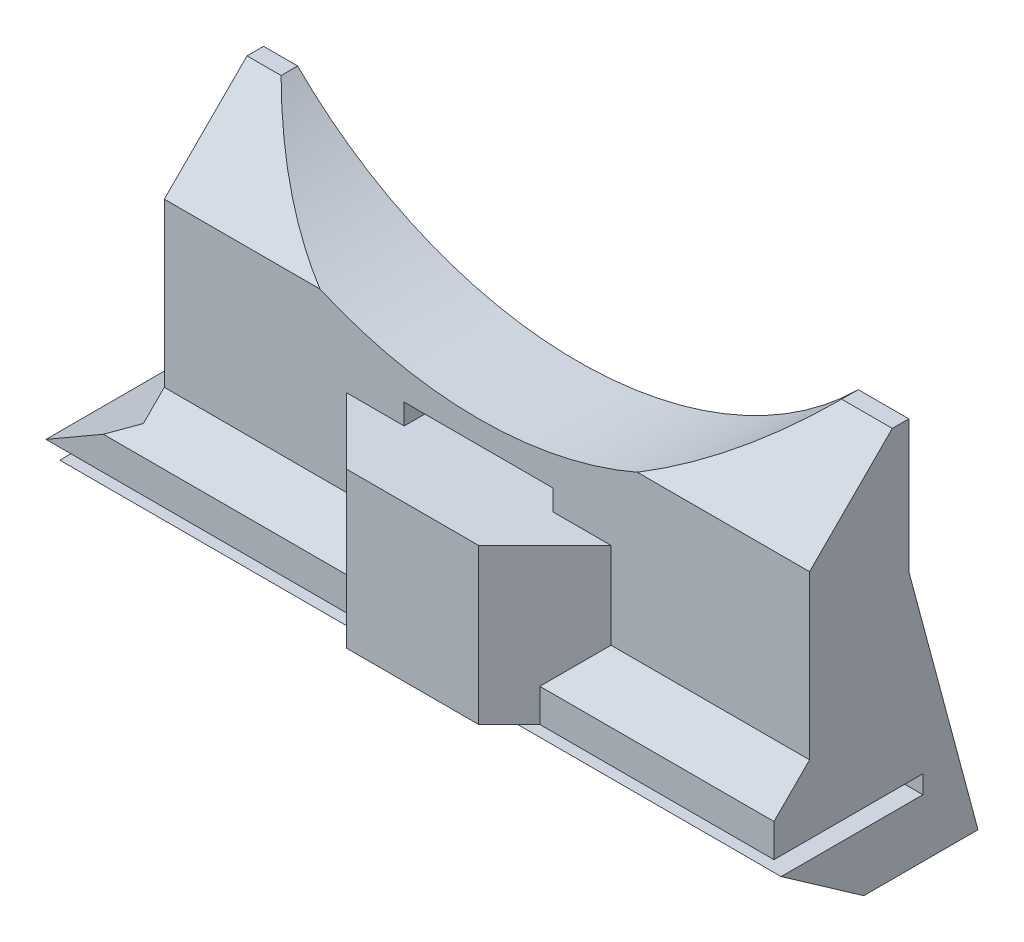
ISO-10303-21;
HEADER;
FILE_DESCRIPTION(('STEP AP214'),'2;1');
FILE_NAME('part.step','',(''),(''),'','','');
FILE_SCHEMA(('AUTOMOTIVE_DESIGN { 1 0 10303 214 1 1 1 1 }'));
ENDSEC;
DATA;
#1=APPLICATION_CONTEXT('core data for automotive mechanical design processes');
#2=APPLICATION_PROTOCOL_DEFINITION('international standard','automotive_design',2000,#1);
#3=PRODUCT_CONTEXT('',#1,'mechanical');
#4=PRODUCT('Part','Part','',(#3));
#5=PRODUCT_RELATED_PRODUCT_CATEGORY('part','',(#4));
#6=PRODUCT_DEFINITION_FORMATION('','',#4);
#7=PRODUCT_DEFINITION_CONTEXT('part definition',#1,'design');
#8=PRODUCT_DEFINITION('design','',#6,#7);
#9=PRODUCT_DEFINITION_SHAPE('','',#8);
#10=(LENGTH_UNIT() NAMED_UNIT(*) SI_UNIT(.MILLI.,.METRE.));
#11=(NAMED_UNIT(*) PLANE_ANGLE_UNIT() SI_UNIT($,.RADIAN.));
#12=(NAMED_UNIT(*) SI_UNIT($,.STERADIAN.) SOLID_ANGLE_UNIT());
#13=UNCERTAINTY_MEASURE_WITH_UNIT(LENGTH_MEASURE(1.E-05),#10,'distance_accuracy_value','');
#14=(GEOMETRIC_REPRESENTATION_CONTEXT(3) GLOBAL_UNCERTAINTY_ASSIGNED_CONTEXT((#13)) GLOBAL_UNIT_ASSIGNED_CONTEXT((#10,
#11,#12)) REPRESENTATION_CONTEXT('',''));
#15=CARTESIAN_POINT('',(0.,0.,0.));
#16=DIRECTION('',(0.,0.,1.));
#17=DIRECTION('',(1.,0.,0.));
#18=AXIS2_PLACEMENT_3D('',#15,#16,#17);
#19=CARTESIAN_POINT('',(20.,5.25011961699659,6.8498803830034));
#20=DIRECTION('',(0.,0.,-1.));
#21=DIRECTION('',(-1.,0.,0.));
#22=AXIS2_PLACEMENT_3D('',#19,#20,#21);
#23=PLANE('',#22);
#24=DIRECTION('',(-1.,0.,0.));
#25=VECTOR('',#24,1.);
#26=CARTESIAN_POINT('',(20.,5.25011961699659,6.8498803830034));
#27=LINE('',#26,#25);
#28=CARTESIAN_POINT('',(-8.,5.25011961699658,6.84988038300341));
#29=VERTEX_POINT('',#28);
#30=CARTESIAN_POINT('',(-19.,5.25011961699659,6.8498803830034));
#31=VERTEX_POINT('',#30);
#32=EDGE_CURVE('E237',#29,#31,#27,.T.);
#33=ORIENTED_EDGE('',*,*,#32,.F.);
#34=DIRECTION('',(0.,1.,0.));
#35=VECTOR('',#34,1.);
#36=CARTESIAN_POINT('',(-8.,-4.55685424949238,6.84988038300341));
#37=LINE('',#36,#35);
#38=CARTESIAN_POINT('',(-8.,10.475,6.84988038300341));
#39=VERTEX_POINT('',#38);
#40=EDGE_CURVE('E230',#29,#39,#37,.T.);
#41=ORIENTED_EDGE('',*,*,#40,.T.);
#42=DIRECTION('',(-1.,0.,0.));
#43=VECTOR('',#42,1.);
#44=CARTESIAN_POINT('',(-4.,10.475,6.84988038300341));
#45=LINE('',#44,#43);
#46=CARTESIAN_POINT('',(-4.50000000000001,10.475,6.84988038300341));
#47=VERTEX_POINT('',#46);
#48=EDGE_CURVE('E215',#47,#39,#45,.T.);
#49=ORIENTED_EDGE('',*,*,#48,.F.);
#50=DIRECTION('',(0.,-1.,0.));
#51=VECTOR('',#50,1.);
#52=CARTESIAN_POINT('',(-4.50000000000001,5.25011961699659,6.8498803830034));
#53=LINE('',#52,#51);
#54=CARTESIAN_POINT('',(-4.50000000000001,11.725,6.8498803830034));
#55=VERTEX_POINT('',#54);
#56=EDGE_CURVE('E425',#55,#47,#53,.T.);
#57=ORIENTED_EDGE('',*,*,#56,.F.);
#58=DIRECTION('',(-1.,0.,0.));
#59=VECTOR('',#58,1.);
#60=CARTESIAN_POINT('',(20.,11.725,6.8498803830034));
#61=LINE('',#60,#59);
#62=CARTESIAN_POINT('',(4.49999999999999,11.725,6.8498803830034));
#63=VERTEX_POINT('',#62);
#64=EDGE_CURVE('E42',#63,#55,#61,.T.);
#65=ORIENTED_EDGE('',*,*,#64,.F.);
#66=DIRECTION('',(0.,1.,0.));
#67=VECTOR('',#66,1.);
#68=CARTESIAN_POINT('',(4.49999999999999,5.25011961699659,6.8498803830034));
#69=LINE('',#68,#67);
#70=CARTESIAN_POINT('',(4.49999999999999,10.475,6.8498803830034));
#71=VERTEX_POINT('',#70);
#72=EDGE_CURVE('E12',#71,#63,#69,.T.);
#73=ORIENTED_EDGE('',*,*,#72,.F.);
#74=DIRECTION('',(-1.,0.,0.));
#75=VECTOR('',#74,1.);
#76=CARTESIAN_POINT('',(4.,10.475,6.8498803830034));
#77=LINE('',#76,#75);
#78=CARTESIAN_POINT('',(8.,10.475,6.8498803830034));
#79=VERTEX_POINT('',#78);
#80=EDGE_CURVE('E248',#79,#71,#77,.T.);
#81=ORIENTED_EDGE('',*,*,#80,.F.);
#82=DIRECTION('',(0.,1.,0.));
#83=VECTOR('',#82,1.);
#84=CARTESIAN_POINT('',(8.,-4.55685424949238,6.8498803830034));
#85=LINE('',#84,#83);
#86=CARTESIAN_POINT('',(8.,5.25011961699659,6.8498803830034));
#87=VERTEX_POINT('',#86);
#88=EDGE_CURVE('E252',#87,#79,#85,.T.);
#89=ORIENTED_EDGE('',*,*,#88,.F.);
#90=CARTESIAN_POINT('',(20.,5.25011961699659,6.8498803830034));
#91=VERTEX_POINT('',#90);
#92=EDGE_CURVE('E378',#91,#87,#27,.T.);
#93=ORIENTED_EDGE('',*,*,#92,.F.);
#94=DIRECTION('',(0.,-1.,0.));
#95=VECTOR('',#94,1.);
#96=CARTESIAN_POINT('',(20.,5.25011961699659,6.8498803830034));
#97=LINE('',#96,#95);
#98=CARTESIAN_POINT('',(20.,15.1,6.8498803830034));
#99=VERTEX_POINT('',#98);
#100=EDGE_CURVE('E342',#99,#91,#97,.T.);
#101=ORIENTED_EDGE('',*,*,#100,.F.);
#102=DIRECTION('',(-1.,0.,0.));
#103=VECTOR('',#102,1.);
#104=CARTESIAN_POINT('',(16.9410743460974,15.1,6.8498803830034));
#105=LINE('',#104,#103);
#106=CARTESIAN_POINT('',(9.59166304662545,15.1,6.84988038300341));
#107=VERTEX_POINT('',#106);
#108=EDGE_CURVE('E384',#99,#107,#105,.T.);
#109=ORIENTED_EDGE('',*,*,#108,.T.);
#110=CARTESIAN_POINT('',(0.,37.1,6.8498803830034));
#111=DIRECTION('',(0.,0.,-1.));
#112=DIRECTION('',(-1.,0.,0.));
#113=AXIS2_PLACEMENT_3D('',#110,#111,#112);
#114=CIRCLE('',#113,24.);
#115=CARTESIAN_POINT('',(-9.59166304662545,15.1,6.84988038300341));
#116=VERTEX_POINT('',#115);
#117=EDGE_CURVE('E316',#107,#116,#114,.T.);
#118=ORIENTED_EDGE('',*,*,#117,.T.);
#119=DIRECTION('',(-1.,0.,0.));
#120=VECTOR('',#119,1.);
#121=CARTESIAN_POINT('',(-20.,15.1,6.8498803830034));
#122=LINE('',#121,#120);
#123=CARTESIAN_POINT('',(-19.,15.1,6.8498803830034));
#124=VERTEX_POINT('',#123);
#125=EDGE_CURVE('E387',#116,#124,#122,.T.);
#126=ORIENTED_EDGE('',*,*,#125,.T.);
#127=DIRECTION('',(0.,-1.,0.));
#128=VECTOR('',#127,1.);
#129=CARTESIAN_POINT('',(-19.,5.25011961699659,6.8498803830034));
#130=LINE('',#129,#128);
#131=EDGE_CURVE('E303',#124,#31,#130,.T.);
#132=ORIENTED_EDGE('',*,*,#131,.T.);
#133=EDGE_LOOP('',(#33,#41,#49,#57,#65,#73,#81,#89,#93,#101,#109,#118,#126,#132));
#134=FACE_BOUND('',#133,.T.);
#135=ADVANCED_FACE('F34',(#134),#23,.F.);
#136=CARTESIAN_POINT('',(20.,3.1,9.));
#137=DIRECTION('',(0.,-0.707106781186549,-0.707106781186546));
#138=DIRECTION('',(0.,0.707106781186546,-0.707106781186549));
#139=AXIS2_PLACEMENT_3D('',#136,#137,#138);
#140=PLANE('',#139);
#141=DIRECTION('',(-1.,0.,0.));
#142=VECTOR('',#141,1.);
#143=CARTESIAN_POINT('',(20.,3.1,9.));
#144=LINE('',#143,#142);
#145=CARTESIAN_POINT('',(-5.8498803830034,3.1,9.));
#146=VERTEX_POINT('',#145);
#147=CARTESIAN_POINT('',(-20.5358983848622,3.1,9.));
#148=VERTEX_POINT('',#147);
#149=EDGE_CURVE('E374',#146,#148,#144,.T.);
#150=ORIENTED_EDGE('',*,*,#149,.F.);
#151=DIRECTION('',(-0.577350269189627,0.577350269189624,-0.577350269189626));
#152=VECTOR('',#151,1.);
#153=CARTESIAN_POINT('',(2.76674641133109,-5.51662679433446,17.6166267943345));
#154=LINE('',#153,#152);
#155=EDGE_CURVE('E246',#146,#29,#154,.T.);
#156=ORIENTED_EDGE('',*,*,#155,.T.);
#157=ORIENTED_EDGE('',*,*,#32,.T.);
#158=DIRECTION('',(0.,-0.707106781186546,0.707106781186549));
#159=VECTOR('',#158,1.);
#160=CARTESIAN_POINT('',(-19.,3.1,9.));
#161=LINE('',#160,#159);
#162=CARTESIAN_POINT('',(-19.,3.98675134594809,8.11324865405191));
#163=VERTEX_POINT('',#162);
#164=EDGE_CURVE('E305',#31,#163,#161,.T.);
#165=ORIENTED_EDGE('',*,*,#164,.T.);
#166=DIRECTION('',(-0.774596669241487,-0.447213595499954,0.447213595499956));
#167=VECTOR('',#166,1.);
#168=CARTESIAN_POINT('',(3.78564064605535,17.142047106606,-5.04204710660609));
#169=LINE('',#168,#167);
#170=EDGE_CURVE('E295',#163,#148,#169,.T.);
#171=ORIENTED_EDGE('',*,*,#170,.T.);
#172=EDGE_LOOP('',(#150,#156,#157,#165,#171));
#173=FACE_BOUND('',#172,.T.);
#174=ADVANCED_FACE('F495',(#173),#140,.F.);
#175=ORIENTED_EDGE('',*,*,#92,.T.);
#176=DIRECTION('',(-0.577350269189627,-0.577350269189624,0.577350269189626));
#177=VECTOR('',#176,1.);
#178=CARTESIAN_POINT('',(10.5665869220023,7.81670653899886,4.28329346100112));
#179=LINE('',#178,#177);
#180=CARTESIAN_POINT('',(5.84988038300341,3.1,9.));
#181=VERTEX_POINT('',#180);
#182=EDGE_CURVE('E260',#87,#181,#179,.T.);
#183=ORIENTED_EDGE('',*,*,#182,.T.);
#184=CARTESIAN_POINT('',(20.,3.1,9.));
#185=VERTEX_POINT('',#184);
#186=EDGE_CURVE('E375',#185,#181,#144,.T.);
#187=ORIENTED_EDGE('',*,*,#186,.F.);
#188=DIRECTION('',(0.,-0.707106781186546,0.707106781186549));
#189=VECTOR('',#188,1.);
#190=CARTESIAN_POINT('',(20.,3.1,9.));
#191=LINE('',#190,#189);
#192=EDGE_CURVE('E344',#91,#185,#191,.T.);
#193=ORIENTED_EDGE('',*,*,#192,.F.);
#194=EDGE_LOOP('',(#175,#183,#187,#193));
#195=FACE_BOUND('',#194,.T.);
#196=ADVANCED_FACE('F462',(#195),#140,.F.);
#197=CARTESIAN_POINT('',(20.,1.1,9.));
#198=DIRECTION('',(0.,0.,-1.));
#199=DIRECTION('',(-1.,0.,0.));
#200=AXIS2_PLACEMENT_3D('',#197,#198,#199);
#201=PLANE('',#200);
#202=DIRECTION('',(-1.,0.,0.));
#203=VECTOR('',#202,1.);
#204=CARTESIAN_POINT('',(20.,1.1,9.));
#205=LINE('',#204,#203);
#206=CARTESIAN_POINT('',(-5.8498803830034,1.1,9.00000000000001));
#207=VERTEX_POINT('',#206);
#208=CARTESIAN_POINT('',(-24.,1.1,9.));
#209=VERTEX_POINT('',#208);
#210=EDGE_CURVE('E370',#207,#209,#205,.T.);
#211=ORIENTED_EDGE('',*,*,#210,.F.);
#212=DIRECTION('',(0.,1.,0.));
#213=VECTOR('',#212,1.);
#214=CARTESIAN_POINT('',(-5.8498803830034,1.1,9.));
#215=LINE('',#214,#213);
#216=EDGE_CURVE('E241',#207,#146,#215,.T.);
#217=ORIENTED_EDGE('',*,*,#216,.T.);
#218=ORIENTED_EDGE('',*,*,#149,.T.);
#219=DIRECTION('',(0.866025403784442,0.499999999999995,0.));
#220=VECTOR('',#219,1.);
#221=CARTESIAN_POINT('',(-24.,1.1,9.));
#222=LINE('',#221,#220);
#223=EDGE_CURVE('E288',#209,#148,#222,.T.);
#224=ORIENTED_EDGE('',*,*,#223,.F.);
#225=EDGE_LOOP('',(#211,#217,#218,#224));
#226=FACE_BOUND('',#225,.T.);
#227=ADVANCED_FACE('F497',(#226),#201,.F.);
#228=ORIENTED_EDGE('',*,*,#186,.T.);
#229=DIRECTION('',(0.,-1.,0.));
#230=VECTOR('',#229,1.);
#231=CARTESIAN_POINT('',(5.84988038300341,1.1,9.));
#232=LINE('',#231,#230);
#233=CARTESIAN_POINT('',(5.84988038300341,1.1,9.));
#234=VERTEX_POINT('',#233);
#235=EDGE_CURVE('E251',#181,#234,#232,.T.);
#236=ORIENTED_EDGE('',*,*,#235,.T.);
#237=CARTESIAN_POINT('',(20.,1.1,9.));
#238=VERTEX_POINT('',#237);
#239=EDGE_CURVE('E371',#238,#234,#205,.T.);
#240=ORIENTED_EDGE('',*,*,#239,.F.);
#241=DIRECTION('',(0.,-1.,0.));
#242=VECTOR('',#241,1.);
#243=CARTESIAN_POINT('',(20.,1.1,9.));
#244=LINE('',#243,#242);
#245=EDGE_CURVE('E346',#185,#238,#244,.T.);
#246=ORIENTED_EDGE('',*,*,#245,.F.);
#247=EDGE_LOOP('',(#228,#236,#240,#246));
#248=FACE_BOUND('',#247,.T.);
#249=ADVANCED_FACE('F457',(#248),#201,.F.);
#250=CARTESIAN_POINT('',(20.,-6.,-4.));
#251=DIRECTION('',(0.,-0.258819045102525,0.965925826289067));
#252=DIRECTION('',(0.,-0.965925826289067,-0.258819045102525));
#253=AXIS2_PLACEMENT_3D('',#250,#251,#252);
#254=PLANE('',#253);
#255=DIRECTION('',(0.,0.965925826289067,0.258819045102525));
#256=VECTOR('',#255,1.);
#257=CARTESIAN_POINT('',(20.,-6.,-4.));
#258=LINE('',#257,#256);
#259=CARTESIAN_POINT('',(20.,-3.50000000000001,-3.33012701892218));
#260=VERTEX_POINT('',#259);
#261=CARTESIAN_POINT('',(20.,12.1,0.849880383003405));
#262=VERTEX_POINT('',#261);
#263=EDGE_CURVE('E335',#260,#262,#258,.T.);
#264=ORIENTED_EDGE('',*,*,#263,.F.);
#265=DIRECTION('',(0.694746590606867,0.694746590606863,0.186156787897388));
#266=VECTOR('',#265,1.);
#267=CARTESIAN_POINT('',(20.4306913006395,-3.06930869936055,-3.21472363272873));
#268=LINE('',#267,#266);
#269=CARTESIAN_POINT('',(17.5,-6.,-4.));
#270=VERTEX_POINT('',#269);
#271=EDGE_CURVE('E420',#260,#270,#268,.F.);
#272=ORIENTED_EDGE('',*,*,#271,.T.);
#273=DIRECTION('',(-1.,0.,0.));
#274=VECTOR('',#273,1.);
#275=CARTESIAN_POINT('',(20.,-6.,-4.));
#276=LINE('',#275,#274);
#277=CARTESIAN_POINT('',(-14.4297335460291,-6.,-4.));
#278=VERTEX_POINT('',#277);
#279=EDGE_CURVE('E357',#270,#278,#276,.T.);
#280=ORIENTED_EDGE('',*,*,#279,.T.);
#281=CARTESIAN_POINT('',(-14.4297335460291,4.,-1.32050807568873));
#282=DIRECTION('',(0.,-0.258819045102525,0.965925826289067));
#283=DIRECTION('',(0.,0.965925826289067,0.258819045102525));
#284=AXIS2_PLACEMENT_3D('',#281,#282,#283);
#285=ELLIPSE('',#284,10.3527618041008,10.);
#286=CARTESIAN_POINT('',(-24.,1.1,-2.097560733739));
#287=VERTEX_POINT('',#286);
#288=EDGE_CURVE('E415',#278,#287,#285,.F.);
#289=ORIENTED_EDGE('',*,*,#288,.T.);
#290=DIRECTION('',(0.858356263574051,0.495572219835073,0.132788176096109));
#291=VECTOR('',#290,1.);
#292=CARTESIAN_POINT('',(5.18110132940853,17.9477167077835,2.41677135242001));
#293=LINE('',#292,#291);
#294=CARTESIAN_POINT('',(-19.,3.98675134594808,-1.32405804184274));
#295=VERTEX_POINT('',#294);
#296=EDGE_CURVE('E300',#287,#295,#293,.T.);
#297=ORIENTED_EDGE('',*,*,#296,.T.);
#298=DIRECTION('',(0.,0.965925826289067,0.258819045102525));
#299=VECTOR('',#298,1.);
#300=CARTESIAN_POINT('',(-19.,-6.,-4.));
#301=LINE('',#300,#299);
#302=CARTESIAN_POINT('',(-19.,12.1,0.849880383003405));
#303=VERTEX_POINT('',#302);
#304=EDGE_CURVE('E310',#295,#303,#301,.T.);
#305=ORIENTED_EDGE('',*,*,#304,.T.);
#306=DIRECTION('',(-1.,0.,0.));
#307=VECTOR('',#306,1.);
#308=CARTESIAN_POINT('',(20.,12.1,0.849880383003405));
#309=LINE('',#308,#307);
#310=EDGE_CURVE('E381',#262,#303,#309,.T.);
#311=ORIENTED_EDGE('',*,*,#310,.F.);
#312=EDGE_LOOP('',(#264,#272,#280,#289,#297,#305,#311));
#313=FACE_BOUND('',#312,.T.);
#314=DIRECTION('',(0.,-0.965925826289067,-0.258819045102525));
#315=VECTOR('',#314,1.);
#316=CARTESIAN_POINT('',(4.49999999999999,-6.,-4.));
#317=LINE('',#316,#315);
#318=CARTESIAN_POINT('',(4.49999999999999,11.725,0.749399435841732));
#319=VERTEX_POINT('',#318);
#320=CARTESIAN_POINT('',(4.49999999999999,10.475,0.414462945302824));
#321=VERTEX_POINT('',#320);
#322=EDGE_CURVE('E286',#319,#321,#317,.T.);
#323=ORIENTED_EDGE('',*,*,#322,.F.);
#324=DIRECTION('',(1.,0.,0.));
#325=VECTOR('',#324,1.);
#326=CARTESIAN_POINT('',(20.,11.725,0.749399435841732));
#327=LINE('',#326,#325);
#328=CARTESIAN_POINT('',(-4.50000000000001,11.725,0.749399435841734));
#329=VERTEX_POINT('',#328);
#330=EDGE_CURVE('E284',#329,#319,#327,.T.);
#331=ORIENTED_EDGE('',*,*,#330,.F.);
#332=DIRECTION('',(0.,0.965925826289067,0.258819045102525));
#333=VECTOR('',#332,1.);
#334=CARTESIAN_POINT('',(-4.50000000000001,-6.,-4.));
#335=LINE('',#334,#333);
#336=CARTESIAN_POINT('',(-4.50000000000001,10.475,0.414462945302825));
#337=VERTEX_POINT('',#336);
#338=EDGE_CURVE('E282',#337,#329,#335,.T.);
#339=ORIENTED_EDGE('',*,*,#338,.F.);
#340=DIRECTION('',(-1.,0.,0.));
#341=VECTOR('',#340,1.);
#342=CARTESIAN_POINT('',(20.,10.475,0.414462945302824));
#343=LINE('',#342,#341);
#344=EDGE_CURVE('E280',#321,#337,#343,.T.);
#345=ORIENTED_EDGE('',*,*,#344,.F.);
#346=EDGE_LOOP('',(#323,#331,#339,#345));
#347=FACE_BOUND('',#346,.T.);
#348=ADVANCED_FACE('F439',(#313,#347),#254,.F.);
#349=CARTESIAN_POINT('',(20.,1.1,0.));
#350=DIRECTION('',(0.,1.,0.));
#351=DIRECTION('',(0.,0.,1.));
#352=AXIS2_PLACEMENT_3D('',#349,#350,#351);
#353=PLANE('',#352);
#354=DIRECTION('',(-0.707106781186548,0.,-0.707106781186547));
#355=VECTOR('',#354,1.);
#356=CARTESIAN_POINT('',(-4.,1.1,10.8498803830034));
#357=LINE('',#356,#355);
#358=CARTESIAN_POINT('',(-4.,1.1,10.8498803830034));
#359=VERTEX_POINT('',#358);
#360=EDGE_CURVE('E238',#359,#207,#357,.T.);
#361=ORIENTED_EDGE('',*,*,#360,.T.);
#362=ORIENTED_EDGE('',*,*,#210,.T.);
#363=DIRECTION('',(0.,0.,1.));
#364=VECTOR('',#363,1.);
#365=CARTESIAN_POINT('',(-24.,1.1,0.));
#366=LINE('',#365,#364);
#367=CARTESIAN_POINT('',(-24.,1.1,0.));
#368=VERTEX_POINT('',#367);
#369=EDGE_CURVE('E313',#368,#209,#366,.T.);
#370=ORIENTED_EDGE('',*,*,#369,.F.);
#371=DIRECTION('',(-1.,0.,0.));
#372=VECTOR('',#371,1.);
#373=CARTESIAN_POINT('',(20.,1.1,0.));
#374=LINE('',#373,#372);
#375=CARTESIAN_POINT('',(20.,1.1,0.));
#376=VERTEX_POINT('',#375);
#377=EDGE_CURVE('E367',#376,#368,#374,.T.);
#378=ORIENTED_EDGE('',*,*,#377,.F.);
#379=DIRECTION('',(0.,0.,-1.));
#380=VECTOR('',#379,1.);
#381=CARTESIAN_POINT('',(20.,1.1,0.));
#382=LINE('',#381,#380);
#383=EDGE_CURVE('E348',#238,#376,#382,.T.);
#384=ORIENTED_EDGE('',*,*,#383,.F.);
#385=ORIENTED_EDGE('',*,*,#239,.T.);
#386=DIRECTION('',(-0.707106781186548,0.,0.707106781186547));
#387=VECTOR('',#386,1.);
#388=CARTESIAN_POINT('',(4.,1.1,10.8498803830034));
#389=LINE('',#388,#387);
#390=CARTESIAN_POINT('',(4.,1.1,10.8498803830034));
#391=VERTEX_POINT('',#390);
#392=EDGE_CURVE('E249',#234,#391,#389,.T.);
#393=ORIENTED_EDGE('',*,*,#392,.T.);
#394=DIRECTION('',(1.,0.,0.));
#395=VECTOR('',#394,1.);
#396=CARTESIAN_POINT('',(-4.,1.1,10.8498803830034));
#397=LINE('',#396,#395);
#398=EDGE_CURVE('E264',#359,#391,#397,.T.);
#399=ORIENTED_EDGE('',*,*,#398,.F.);
#400=EDGE_LOOP('',(#361,#362,#370,#378,#384,#385,#393,#399));
#401=FACE_BOUND('',#400,.T.);
#402=ADVANCED_FACE('F452',(#401),#353,.F.);
#403=CARTESIAN_POINT('',(20.,0.,0.));
#404=DIRECTION('',(0.,0.,-1.));
#405=DIRECTION('',(-1.,0.,0.));
#406=AXIS2_PLACEMENT_3D('',#403,#404,#405);
#407=PLANE('',#406);
#408=ORIENTED_EDGE('',*,*,#377,.T.);
#409=CARTESIAN_POINT('',(-14.4297335460291,4.,0.));
#410=DIRECTION('',(0.,0.,-1.));
#411=DIRECTION('',(-1.,0.,0.));
#412=AXIS2_PLACEMENT_3D('',#409,#410,#411);
#413=CIRCLE('',#412,10.);
#414=CARTESIAN_POINT('',(-23.5948849359408,0.,0.));
#415=VERTEX_POINT('',#414);
#416=EDGE_CURVE('E405',#368,#415,#413,.F.);
#417=ORIENTED_EDGE('',*,*,#416,.T.);
#418=DIRECTION('',(-1.,0.,0.));
#419=VECTOR('',#418,1.);
#420=CARTESIAN_POINT('',(20.,0.,0.));
#421=LINE('',#420,#419);
#422=CARTESIAN_POINT('',(20.,0.,0.));
#423=VERTEX_POINT('',#422);
#424=EDGE_CURVE('E364',#423,#415,#421,.T.);
#425=ORIENTED_EDGE('',*,*,#424,.F.);
#426=DIRECTION('',(0.,-1.,0.));
#427=VECTOR('',#426,1.);
#428=CARTESIAN_POINT('',(20.,0.,0.));
#429=LINE('',#428,#427);
#430=EDGE_CURVE('E350',#376,#423,#429,.T.);
#431=ORIENTED_EDGE('',*,*,#430,.F.);
#432=EDGE_LOOP('',(#408,#417,#425,#431));
#433=FACE_BOUND('',#432,.T.);
#434=ADVANCED_FACE('F509',(#433),#407,.F.);
#435=CARTESIAN_POINT('',(20.,0.,8.56888804045279));
#436=DIRECTION('',(0.,-1.,0.));
#437=DIRECTION('',(0.,0.,-1.));
#438=AXIS2_PLACEMENT_3D('',#435,#436,#437);
#439=PLANE('',#438);
#440=ORIENTED_EDGE('',*,*,#424,.T.);
#441=DIRECTION('',(0.,0.,1.));
#442=VECTOR('',#441,1.);
#443=CARTESIAN_POINT('',(-23.5948849359408,0.,0.));
#444=LINE('',#443,#442);
#445=CARTESIAN_POINT('',(-23.5948849359408,0.,8.56888804045279));
#446=VERTEX_POINT('',#445);
#447=EDGE_CURVE('E407',#415,#446,#444,.T.);
#448=ORIENTED_EDGE('',*,*,#447,.T.);
#449=DIRECTION('',(-1.,0.,0.));
#450=VECTOR('',#449,1.);
#451=CARTESIAN_POINT('',(20.,0.,8.56888804045279));
#452=LINE('',#451,#450);
#453=CARTESIAN_POINT('',(20.,0.,8.56888804045279));
#454=VERTEX_POINT('',#453);
#455=EDGE_CURVE('E361',#454,#446,#452,.T.);
#456=ORIENTED_EDGE('',*,*,#455,.F.);
#457=DIRECTION('',(0.,0.,1.));
#458=VECTOR('',#457,1.);
#459=CARTESIAN_POINT('',(20.,0.,8.56888804045279));
#460=LINE('',#459,#458);
#461=EDGE_CURVE('E352',#423,#454,#460,.T.);
#462=ORIENTED_EDGE('',*,*,#461,.F.);
#463=EDGE_LOOP('',(#440,#448,#456,#462));
#464=FACE_BOUND('',#463,.T.);
#465=ADVANCED_FACE('F516',(#464),#439,.F.);
#466=CARTESIAN_POINT('',(20.,-6.,0.));
#467=DIRECTION('',(0.,0.819152044288995,-0.573576436351041));
#468=DIRECTION('',(0.,0.573576436351041,0.819152044288995));
#469=AXIS2_PLACEMENT_3D('',#466,#467,#468);
#470=PLANE('',#469);
#471=DIRECTION('',(-1.,0.,0.));
#472=VECTOR('',#471,1.);
#473=CARTESIAN_POINT('',(20.,-6.,0.));
#474=LINE('',#473,#472);
#475=CARTESIAN_POINT('',(17.5,-6.,0.));
#476=VERTEX_POINT('',#475);
#477=CARTESIAN_POINT('',(-14.4297335460291,-6.,0.));
#478=VERTEX_POINT('',#477);
#479=EDGE_CURVE('E359',#476,#478,#474,.T.);
#480=ORIENTED_EDGE('',*,*,#479,.F.);
#481=DIRECTION('',(-0.497542812164522,-0.497542812164519,-0.710564775461633));
#482=VECTOR('',#481,1.);
#483=CARTESIAN_POINT('',(18.7377442496829,-4.76225575031711,1.76768198304116));
#484=LINE('',#483,#482);
#485=CARTESIAN_POINT('',(20.,-3.5,3.57037001685532));
#486=VERTEX_POINT('',#485);
#487=EDGE_CURVE('E423',#476,#486,#484,.F.);
#488=ORIENTED_EDGE('',*,*,#487,.T.);
#489=DIRECTION('',(0.,-0.573576436351041,-0.819152044288995));
#490=VECTOR('',#489,1.);
#491=CARTESIAN_POINT('',(20.,-6.,0.));
#492=LINE('',#491,#490);
#493=EDGE_CURVE('E354',#454,#486,#492,.T.);
#494=ORIENTED_EDGE('',*,*,#493,.F.);
#495=ORIENTED_EDGE('',*,*,#455,.T.);
#496=CARTESIAN_POINT('',(-14.4297335460291,4.,14.2814800674213));
#497=DIRECTION('',(0.,0.819152044288995,-0.573576436351041));
#498=DIRECTION('',(0.,0.573576436351041,0.819152044288995));
#499=AXIS2_PLACEMENT_3D('',#496,#497,#498);
#500=ELLIPSE('',#499,17.4344679562111,10.);
#501=EDGE_CURVE('E409',#446,#478,#500,.F.);
#502=ORIENTED_EDGE('',*,*,#501,.T.);
#503=EDGE_LOOP('',(#480,#488,#494,#495,#502));
#504=FACE_BOUND('',#503,.T.);
#505=ADVANCED_FACE('F520',(#504),#470,.F.);
#506=CARTESIAN_POINT('',(20.,-6.,0.));
#507=DIRECTION('',(0.,1.,0.));
#508=DIRECTION('',(0.,0.,1.));
#509=AXIS2_PLACEMENT_3D('',#506,#507,#508);
#510=PLANE('',#509);
#511=ORIENTED_EDGE('',*,*,#279,.F.);
#512=DIRECTION('',(0.,0.,1.));
#513=VECTOR('',#512,1.);
#514=CARTESIAN_POINT('',(17.5,-6.,0.));
#515=LINE('',#514,#513);
#516=EDGE_CURVE('E57',#270,#476,#515,.T.);
#517=ORIENTED_EDGE('',*,*,#516,.T.);
#518=ORIENTED_EDGE('',*,*,#479,.T.);
#519=DIRECTION('',(0.,0.,1.));
#520=VECTOR('',#519,1.);
#521=CARTESIAN_POINT('',(-14.4297335460291,-6.,0.));
#522=LINE('',#521,#520);
#523=EDGE_CURVE('E412',#478,#278,#522,.F.);
#524=ORIENTED_EDGE('',*,*,#523,.T.);
#525=EDGE_LOOP('',(#511,#517,#518,#524));
#526=FACE_BOUND('',#525,.T.);
#527=ADVANCED_FACE('F527',(#526),#510,.F.);
#528=CARTESIAN_POINT('',(20.,0.,0.));
#529=DIRECTION('',(-1.,0.,0.));
#530=DIRECTION('',(0.,0.,1.));
#531=AXIS2_PLACEMENT_3D('',#528,#529,#530);
#532=PLANE('',#531);
#533=ORIENTED_EDGE('',*,*,#493,.T.);
#534=DIRECTION('',(0.,0.,-1.));
#535=VECTOR('',#534,1.);
#536=CARTESIAN_POINT('',(20.,-3.5,0.));
#537=LINE('',#536,#535);
#538=EDGE_CURVE('E417',#486,#260,#537,.T.);
#539=ORIENTED_EDGE('',*,*,#538,.T.);
#540=ORIENTED_EDGE('',*,*,#263,.T.);
#541=DIRECTION('',(0.,1.,0.));
#542=VECTOR('',#541,1.);
#543=CARTESIAN_POINT('',(20.,12.1,0.849880383003405));
#544=LINE('',#543,#542);
#545=CARTESIAN_POINT('',(20.,20.1,0.849880383003405));
#546=VERTEX_POINT('',#545);
#547=EDGE_CURVE('E320',#262,#546,#544,.T.);
#548=ORIENTED_EDGE('',*,*,#547,.T.);
#549=DIRECTION('',(0.,0.,1.));
#550=VECTOR('',#549,1.);
#551=CARTESIAN_POINT('',(20.,20.1,0.849880383003405));
#552=LINE('',#551,#550);
#553=CARTESIAN_POINT('',(20.,20.1,1.84988038300339));
#554=VERTEX_POINT('',#553);
#555=EDGE_CURVE('E329',#546,#554,#552,.T.);
#556=ORIENTED_EDGE('',*,*,#555,.T.);
#557=DIRECTION('',(0.,-0.707106781186546,0.707106781186549));
#558=VECTOR('',#557,1.);
#559=CARTESIAN_POINT('',(20.,15.1,6.8498803830034));
#560=LINE('',#559,#558);
#561=EDGE_CURVE('E398',#554,#99,#560,.T.);
#562=ORIENTED_EDGE('',*,*,#561,.T.);
#563=ORIENTED_EDGE('',*,*,#100,.T.);
#564=ORIENTED_EDGE('',*,*,#192,.T.);
#565=ORIENTED_EDGE('',*,*,#245,.T.);
#566=ORIENTED_EDGE('',*,*,#383,.T.);
#567=ORIENTED_EDGE('',*,*,#430,.T.);
#568=ORIENTED_EDGE('',*,*,#461,.T.);
#569=EDGE_LOOP('',(#533,#539,#540,#548,#556,#562,#563,#564,#565,#566,#567,#568));
#570=FACE_BOUND('',#569,.T.);
#571=ADVANCED_FACE('F511',(#570),#532,.F.);
#572=CARTESIAN_POINT('',(-20.,20.1,0.849880383003405));
#573=DIRECTION('',(0.,1.,0.));
#574=DIRECTION('',(0.,0.,1.));
#575=AXIS2_PLACEMENT_3D('',#572,#573,#574);
#576=PLANE('',#575);
#577=DIRECTION('',(0.,0.,1.));
#578=VECTOR('',#577,1.);
#579=CARTESIAN_POINT('',(-19.,20.1,-4.));
#580=LINE('',#579,#578);
#581=CARTESIAN_POINT('',(-19.,20.1,0.849880383003405));
#582=VERTEX_POINT('',#581);
#583=CARTESIAN_POINT('',(-19.,20.1,1.84988038300339));
#584=VERTEX_POINT('',#583);
#585=EDGE_CURVE('E292',#582,#584,#580,.T.);
#586=ORIENTED_EDGE('',*,*,#585,.T.);
#587=DIRECTION('',(1.,0.,0.));
#588=VECTOR('',#587,1.);
#589=CARTESIAN_POINT('',(-16.9410743460974,20.1,1.84988038300339));
#590=LINE('',#589,#588);
#591=CARTESIAN_POINT('',(-16.9410743460974,20.1,1.84988038300339));
#592=VERTEX_POINT('',#591);
#593=EDGE_CURVE('E390',#584,#592,#590,.T.);
#594=ORIENTED_EDGE('',*,*,#593,.T.);
#595=DIRECTION('',(0.,0.,1.));
#596=VECTOR('',#595,1.);
#597=CARTESIAN_POINT('',(-16.9410743460974,20.1,0.849880383003405));
#598=LINE('',#597,#596);
#599=CARTESIAN_POINT('',(-16.9410743460974,20.1,0.849880383003405));
#600=VERTEX_POINT('',#599);
#601=EDGE_CURVE('E332',#600,#592,#598,.T.);
#602=ORIENTED_EDGE('',*,*,#601,.F.);
#603=DIRECTION('',(-1.,0.,0.));
#604=VECTOR('',#603,1.);
#605=CARTESIAN_POINT('',(-20.,20.1,0.849880383003405));
#606=LINE('',#605,#604);
#607=EDGE_CURVE('E317',#600,#582,#606,.T.);
#608=ORIENTED_EDGE('',*,*,#607,.T.);
#609=EDGE_LOOP('',(#586,#594,#602,#608));
#610=FACE_BOUND('',#609,.T.);
#611=ADVANCED_FACE('F530',(#610),#576,.T.);
#612=CARTESIAN_POINT('',(0.,37.1,0.849880383003405));
#613=DIRECTION('',(0.,0.,1.));
#614=DIRECTION('',(1.,0.,0.));
#615=AXIS2_PLACEMENT_3D('',#612,#613,#614);
#616=CYLINDRICAL_SURFACE('',#615,24.);
#617=ORIENTED_EDGE('',*,*,#601,.T.);
#618=CARTESIAN_POINT('',(0.,37.1,-15.1501196169967));
#619=DIRECTION('',(0.,0.707106781186549,0.707106781186546));
#620=DIRECTION('',(0.,-0.707106781186546,0.707106781186549));
#621=AXIS2_PLACEMENT_3D('',#618,#619,#620);
#622=ELLIPSE('',#621,33.9411254969544,24.);
#623=EDGE_CURVE('E394',#592,#116,#622,.T.);
#624=ORIENTED_EDGE('',*,*,#623,.T.);
#625=ORIENTED_EDGE('',*,*,#117,.F.);
#626=CARTESIAN_POINT('',(0.,37.1,-15.1501196169967));
#627=DIRECTION('',(0.,0.707106781186549,0.707106781186546));
#628=DIRECTION('',(0.,-0.707106781186546,0.707106781186549));
#629=AXIS2_PLACEMENT_3D('',#626,#627,#628);
#630=ELLIPSE('',#629,33.9411254969544,24.);
#631=CARTESIAN_POINT('',(16.9410743460974,20.1,1.84988038300339));
#632=VERTEX_POINT('',#631);
#633=EDGE_CURVE('E392',#107,#632,#630,.T.);
#634=ORIENTED_EDGE('',*,*,#633,.T.);
#635=DIRECTION('',(0.,0.,1.));
#636=VECTOR('',#635,1.);
#637=CARTESIAN_POINT('',(16.9410743460974,20.1,0.849880383003405));
#638=LINE('',#637,#636);
#639=CARTESIAN_POINT('',(16.9410743460974,20.1,0.849880383003405));
#640=VERTEX_POINT('',#639);
#641=EDGE_CURVE('E336',#640,#632,#638,.T.);
#642=ORIENTED_EDGE('',*,*,#641,.F.);
#643=CARTESIAN_POINT('',(0.,37.1,0.849880383003405));
#644=DIRECTION('',(0.,0.,-1.));
#645=DIRECTION('',(-1.,0.,0.));
#646=AXIS2_PLACEMENT_3D('',#643,#644,#645);
#647=CIRCLE('',#646,24.);
#648=EDGE_CURVE('E326',#640,#600,#647,.T.);
#649=ORIENTED_EDGE('',*,*,#648,.T.);
#650=EDGE_LOOP('',(#617,#624,#625,#634,#642,#649));
#651=FACE_BOUND('',#650,.T.);
#652=ADVANCED_FACE('F472',(#651),#616,.F.);
#653=CARTESIAN_POINT('',(20.,20.1,0.849880383003405));
#654=DIRECTION('',(0.,1.,0.));
#655=DIRECTION('',(0.,0.,1.));
#656=AXIS2_PLACEMENT_3D('',#653,#654,#655);
#657=PLANE('',#656);
#658=ORIENTED_EDGE('',*,*,#641,.T.);
#659=DIRECTION('',(1.,0.,0.));
#660=VECTOR('',#659,1.);
#661=CARTESIAN_POINT('',(20.,20.1,1.84988038300339));
#662=LINE('',#661,#660);
#663=EDGE_CURVE('E396',#632,#554,#662,.T.);
#664=ORIENTED_EDGE('',*,*,#663,.T.);
#665=ORIENTED_EDGE('',*,*,#555,.F.);
#666=DIRECTION('',(-1.,0.,0.));
#667=VECTOR('',#666,1.);
#668=CARTESIAN_POINT('',(20.,20.1,0.849880383003405));
#669=LINE('',#668,#667);
#670=EDGE_CURVE('E323',#546,#640,#669,.T.);
#671=ORIENTED_EDGE('',*,*,#670,.T.);
#672=EDGE_LOOP('',(#658,#664,#665,#671));
#673=FACE_BOUND('',#672,.T.);
#674=ADVANCED_FACE('F474',(#673),#657,.T.);
#675=CARTESIAN_POINT('',(0.,37.1,0.849880383003405));
#676=DIRECTION('',(0.,0.,-1.));
#677=DIRECTION('',(-1.,0.,0.));
#678=AXIS2_PLACEMENT_3D('',#675,#676,#677);
#679=PLANE('',#678);
#680=DIRECTION('',(0.,-1.,0.));
#681=VECTOR('',#680,1.);
#682=CARTESIAN_POINT('',(-19.,37.1,0.849880383003405));
#683=LINE('',#682,#681);
#684=EDGE_CURVE('E308',#582,#303,#683,.T.);
#685=ORIENTED_EDGE('',*,*,#684,.F.);
#686=ORIENTED_EDGE('',*,*,#607,.F.);
#687=ORIENTED_EDGE('',*,*,#648,.F.);
#688=ORIENTED_EDGE('',*,*,#670,.F.);
#689=ORIENTED_EDGE('',*,*,#547,.F.);
#690=ORIENTED_EDGE('',*,*,#310,.T.);
#691=EDGE_LOOP('',(#685,#686,#687,#688,#689,#690));
#692=FACE_BOUND('',#691,.T.);
#693=ADVANCED_FACE('F481',(#692),#679,.T.);
#694=CARTESIAN_POINT('',(20.,15.1,6.8498803830034));
#695=DIRECTION('',(0.,0.707106781186549,0.707106781186546));
#696=DIRECTION('',(1.,0.,0.));
#697=AXIS2_PLACEMENT_3D('',#694,#695,#696);
#698=PLANE('',#697);
#699=DIRECTION('',(0.,0.707106781186546,-0.707106781186549));
#700=VECTOR('',#699,1.);
#701=CARTESIAN_POINT('',(-19.,15.1,6.8498803830034));
#702=LINE('',#701,#700);
#703=EDGE_CURVE('E403',#124,#584,#702,.T.);
#704=ORIENTED_EDGE('',*,*,#703,.F.);
#705=ORIENTED_EDGE('',*,*,#125,.F.);
#706=ORIENTED_EDGE('',*,*,#623,.F.);
#707=ORIENTED_EDGE('',*,*,#593,.F.);
#708=EDGE_LOOP('',(#704,#705,#706,#707));
#709=FACE_BOUND('',#708,.T.);
#710=ADVANCED_FACE('F488',(#709),#698,.T.);
#711=CARTESIAN_POINT('',(20.,15.1,6.8498803830034));
#712=DIRECTION('',(0.,0.707106781186549,0.707106781186546));
#713=DIRECTION('',(1.,0.,0.));
#714=AXIS2_PLACEMENT_3D('',#711,#712,#713);
#715=PLANE('',#714);
#716=ORIENTED_EDGE('',*,*,#561,.F.);
#717=ORIENTED_EDGE('',*,*,#663,.F.);
#718=ORIENTED_EDGE('',*,*,#633,.F.);
#719=ORIENTED_EDGE('',*,*,#108,.F.);
#720=EDGE_LOOP('',(#716,#717,#718,#719));
#721=FACE_BOUND('',#720,.T.);
#722=ADVANCED_FACE('F469',(#721),#715,.T.);
#723=CARTESIAN_POINT('',(-19.,3.98675134594809,-4.));
#724=DIRECTION('',(1.,0.,0.));
#725=DIRECTION('',(0.,0.,-1.));
#726=AXIS2_PLACEMENT_3D('',#723,#724,#725);
#727=PLANE('',#726);
#728=DIRECTION('',(0.,0.,1.));
#729=VECTOR('',#728,1.);
#730=CARTESIAN_POINT('',(-19.,3.98675134594809,-4.));
#731=LINE('',#730,#729);
#732=EDGE_CURVE('E291',#295,#163,#731,.T.);
#733=ORIENTED_EDGE('',*,*,#732,.T.);
#734=ORIENTED_EDGE('',*,*,#164,.F.);
#735=ORIENTED_EDGE('',*,*,#131,.F.);
#736=ORIENTED_EDGE('',*,*,#703,.T.);
#737=ORIENTED_EDGE('',*,*,#585,.F.);
#738=ORIENTED_EDGE('',*,*,#684,.T.);
#739=ORIENTED_EDGE('',*,*,#304,.F.);
#740=EDGE_LOOP('',(#733,#734,#735,#736,#737,#738,#739));
#741=FACE_BOUND('',#740,.T.);
#742=ADVANCED_FACE('F491',(#741),#727,.F.);
#743=CARTESIAN_POINT('',(-24.,1.1,-4.));
#744=DIRECTION('',(0.499999999999995,-0.866025403784441,0.));
#745=DIRECTION('',(0.866025403784442,0.499999999999995,0.));
#746=AXIS2_PLACEMENT_3D('',#743,#744,#745);
#747=PLANE('',#746);
#748=DIRECTION('',(0.,0.,1.));
#749=VECTOR('',#748,1.);
#750=CARTESIAN_POINT('',(-24.,1.1,0.));
#751=LINE('',#750,#749);
#752=EDGE_CURVE('E400',#287,#368,#751,.T.);
#753=ORIENTED_EDGE('',*,*,#752,.T.);
#754=ORIENTED_EDGE('',*,*,#369,.T.);
#755=ORIENTED_EDGE('',*,*,#223,.T.);
#756=ORIENTED_EDGE('',*,*,#170,.F.);
#757=ORIENTED_EDGE('',*,*,#732,.F.);
#758=ORIENTED_EDGE('',*,*,#296,.F.);
#759=EDGE_LOOP('',(#753,#754,#755,#756,#757,#758));
#760=FACE_BOUND('',#759,.T.);
#761=ADVANCED_FACE('F502',(#760),#747,.F.);
#762=CARTESIAN_POINT('',(-14.4297335460291,4.,0.));
#763=DIRECTION('',(0.,0.,1.));
#764=DIRECTION('',(1.,0.,0.));
#765=AXIS2_PLACEMENT_3D('',#762,#763,#764);
#766=CYLINDRICAL_SURFACE('',#765,10.);
#767=ORIENTED_EDGE('',*,*,#288,.F.);
#768=ORIENTED_EDGE('',*,*,#523,.F.);
#769=ORIENTED_EDGE('',*,*,#501,.F.);
#770=ORIENTED_EDGE('',*,*,#447,.F.);
#771=ORIENTED_EDGE('',*,*,#416,.F.);
#772=ORIENTED_EDGE('',*,*,#752,.F.);
#773=EDGE_LOOP('',(#767,#768,#769,#770,#771,#772));
#774=FACE_BOUND('',#773,.T.);
#775=ADVANCED_FACE('F529',(#774),#766,.T.);
#776=CARTESIAN_POINT('',(20.,-3.5,0.));
#777=DIRECTION('',(-0.707106781186545,0.707106781186549,0.));
#778=DIRECTION('',(0.,0.,-1.));
#779=AXIS2_PLACEMENT_3D('',#776,#777,#778);
#780=PLANE('',#779);
#781=ORIENTED_EDGE('',*,*,#487,.F.);
#782=ORIENTED_EDGE('',*,*,#516,.F.);
#783=ORIENTED_EDGE('',*,*,#271,.F.);
#784=ORIENTED_EDGE('',*,*,#538,.F.);
#785=EDGE_LOOP('',(#781,#782,#783,#784));
#786=FACE_BOUND('',#785,.T.);
#787=ADVANCED_FACE('F36',(#786),#780,.F.);
#788=CARTESIAN_POINT('',(4.49999999999999,11.725,9.));
#789=DIRECTION('',(-1.,0.,0.));
#790=DIRECTION('',(0.,0.,1.));
#791=AXIS2_PLACEMENT_3D('',#788,#789,#790);
#792=PLANE('',#791);
#793=ORIENTED_EDGE('',*,*,#322,.T.);
#794=DIRECTION('',(0.,0.,-1.));
#795=VECTOR('',#794,1.);
#796=CARTESIAN_POINT('',(4.49999999999999,10.475,9.));
#797=LINE('',#796,#795);
#798=EDGE_CURVE('E49',#71,#321,#797,.T.);
#799=ORIENTED_EDGE('',*,*,#798,.F.);
#800=ORIENTED_EDGE('',*,*,#72,.T.);
#801=DIRECTION('',(0.,0.,-1.));
#802=VECTOR('',#801,1.);
#803=CARTESIAN_POINT('',(4.49999999999999,11.725,9.));
#804=LINE('',#803,#802);
#805=EDGE_CURVE('E277',#63,#319,#804,.T.);
#806=ORIENTED_EDGE('',*,*,#805,.T.);
#807=EDGE_LOOP('',(#793,#799,#800,#806));
#808=FACE_BOUND('',#807,.T.);
#809=ADVANCED_FACE('F441',(#808),#792,.T.);
#810=CARTESIAN_POINT('',(-4.50000000000001,11.725,9.));
#811=DIRECTION('',(0.,-1.,0.));
#812=DIRECTION('',(0.,0.,-1.));
#813=AXIS2_PLACEMENT_3D('',#810,#811,#812);
#814=PLANE('',#813);
#815=ORIENTED_EDGE('',*,*,#330,.T.);
#816=ORIENTED_EDGE('',*,*,#805,.F.);
#817=ORIENTED_EDGE('',*,*,#64,.T.);
#818=DIRECTION('',(0.,0.,-1.));
#819=VECTOR('',#818,1.);
#820=CARTESIAN_POINT('',(-4.50000000000001,11.725,9.));
#821=LINE('',#820,#819);
#822=EDGE_CURVE('E274',#55,#329,#821,.T.);
#823=ORIENTED_EDGE('',*,*,#822,.T.);
#824=EDGE_LOOP('',(#815,#816,#817,#823));
#825=FACE_BOUND('',#824,.T.);
#826=ADVANCED_FACE('F430',(#825),#814,.T.);
#827=CARTESIAN_POINT('',(-4.50000000000001,11.725,9.));
#828=DIRECTION('',(1.,0.,0.));
#829=DIRECTION('',(0.,0.,-1.));
#830=AXIS2_PLACEMENT_3D('',#827,#828,#829);
#831=PLANE('',#830);
#832=ORIENTED_EDGE('',*,*,#338,.T.);
#833=ORIENTED_EDGE('',*,*,#822,.F.);
#834=ORIENTED_EDGE('',*,*,#56,.T.);
#835=DIRECTION('',(0.,0.,-1.));
#836=VECTOR('',#835,1.);
#837=CARTESIAN_POINT('',(-4.50000000000001,10.475,9.));
#838=LINE('',#837,#836);
#839=EDGE_CURVE('E222',#47,#337,#838,.T.);
#840=ORIENTED_EDGE('',*,*,#839,.T.);
#841=EDGE_LOOP('',(#832,#833,#834,#840));
#842=FACE_BOUND('',#841,.T.);
#843=ADVANCED_FACE('F434',(#842),#831,.T.);
#844=CARTESIAN_POINT('',(-4.50000000000001,10.475,9.));
#845=DIRECTION('',(0.,1.,0.));
#846=DIRECTION('',(0.,0.,1.));
#847=AXIS2_PLACEMENT_3D('',#844,#845,#846);
#848=PLANE('',#847);
#849=ORIENTED_EDGE('',*,*,#80,.T.);
#850=ORIENTED_EDGE('',*,*,#798,.T.);
#851=ORIENTED_EDGE('',*,*,#344,.T.);
#852=ORIENTED_EDGE('',*,*,#839,.F.);
#853=ORIENTED_EDGE('',*,*,#48,.T.);
#854=DIRECTION('',(0.707106781186548,0.,0.707106781186547));
#855=VECTOR('',#854,1.);
#856=CARTESIAN_POINT('',(-4.,10.475,10.8498803830034));
#857=LINE('',#856,#855);
#858=CARTESIAN_POINT('',(-4.,10.475,10.8498803830034));
#859=VERTEX_POINT('',#858);
#860=EDGE_CURVE('E219',#39,#859,#857,.T.);
#861=ORIENTED_EDGE('',*,*,#860,.T.);
#862=DIRECTION('',(-1.,0.,0.));
#863=VECTOR('',#862,1.);
#864=CARTESIAN_POINT('',(-4.,10.475,10.8498803830034));
#865=LINE('',#864,#863);
#866=CARTESIAN_POINT('',(4.,10.475,10.8498803830034));
#867=VERTEX_POINT('',#866);
#868=EDGE_CURVE('E270',#867,#859,#865,.T.);
#869=ORIENTED_EDGE('',*,*,#868,.F.);
#870=DIRECTION('',(0.707106781186548,0.,-0.707106781186547));
#871=VECTOR('',#870,1.);
#872=CARTESIAN_POINT('',(4.,10.475,10.8498803830034));
#873=LINE('',#872,#871);
#874=EDGE_CURVE('E254',#867,#79,#873,.T.);
#875=ORIENTED_EDGE('',*,*,#874,.T.);
#876=EDGE_LOOP('',(#849,#850,#851,#852,#853,#861,#869,#875));
#877=FACE_BOUND('',#876,.T.);
#878=ADVANCED_FACE('F217',(#877),#848,.T.);
#879=CARTESIAN_POINT('',(0.,0.,10.8498803830034));
#880=DIRECTION('',(0.,0.,1.));
#881=DIRECTION('',(1.,0.,0.));
#882=AXIS2_PLACEMENT_3D('',#879,#880,#881);
#883=PLANE('',#882);
#884=DIRECTION('',(0.,-1.,0.));
#885=VECTOR('',#884,1.);
#886=CARTESIAN_POINT('',(-4.,10.475,10.8498803830034));
#887=LINE('',#886,#885);
#888=EDGE_CURVE('E233',#859,#359,#887,.T.);
#889=ORIENTED_EDGE('',*,*,#888,.T.);
#890=ORIENTED_EDGE('',*,*,#398,.T.);
#891=DIRECTION('',(0.,1.,0.));
#892=VECTOR('',#891,1.);
#893=CARTESIAN_POINT('',(4.,10.475,10.8498803830034));
#894=LINE('',#893,#892);
#895=EDGE_CURVE('E267',#391,#867,#894,.T.);
#896=ORIENTED_EDGE('',*,*,#895,.T.);
#897=ORIENTED_EDGE('',*,*,#868,.T.);
#898=EDGE_LOOP('',(#889,#890,#896,#897));
#899=FACE_BOUND('',#898,.T.);
#900=ADVANCED_FACE('F449',(#899),#883,.T.);
#901=CARTESIAN_POINT('',(4.,-4.55685424949238,10.8498803830034));
#902=DIRECTION('',(0.707106781186547,0.,0.707106781186548));
#903=DIRECTION('',(0.707106781186548,0.,-0.707106781186547));
#904=AXIS2_PLACEMENT_3D('',#901,#902,#903);
#905=PLANE('',#904);
#906=ORIENTED_EDGE('',*,*,#182,.F.);
#907=ORIENTED_EDGE('',*,*,#88,.T.);
#908=ORIENTED_EDGE('',*,*,#874,.F.);
#909=ORIENTED_EDGE('',*,*,#895,.F.);
#910=ORIENTED_EDGE('',*,*,#392,.F.);
#911=ORIENTED_EDGE('',*,*,#235,.F.);
#912=EDGE_LOOP('',(#906,#907,#908,#909,#910,#911));
#913=FACE_BOUND('',#912,.T.);
#914=ADVANCED_FACE('F447',(#913),#905,.T.);
#915=CARTESIAN_POINT('',(-4.,-4.55685424949238,10.8498803830034));
#916=DIRECTION('',(-0.707106781186547,0.,0.707106781186548));
#917=DIRECTION('',(0.707106781186548,0.,0.707106781186547));
#918=AXIS2_PLACEMENT_3D('',#915,#916,#917);
#919=PLANE('',#918);
#920=ORIENTED_EDGE('',*,*,#155,.F.);
#921=ORIENTED_EDGE('',*,*,#216,.F.);
#922=ORIENTED_EDGE('',*,*,#360,.F.);
#923=ORIENTED_EDGE('',*,*,#888,.F.);
#924=ORIENTED_EDGE('',*,*,#860,.F.);
#925=ORIENTED_EDGE('',*,*,#40,.F.);
#926=EDGE_LOOP('',(#920,#921,#922,#923,#924,#925));
#927=FACE_BOUND('',#926,.T.);
#928=ADVANCED_FACE('F229',(#927),#919,.T.);
#929=CLOSED_SHELL('',(#135,#174,#196,#227,#249,#348,#402,#434,#465,#505,#527,#571,#611,#652,
#674,#693,#710,#722,#742,#761,#775,#787,#809,#826,#843,#878,#900,#914,#928));
#930=MANIFOLD_SOLID_BREP('B2',#929);
#931=ADVANCED_BREP_SHAPE_REPRESENTATION('',(#18,#930),#14);
#932=SHAPE_DEFINITION_REPRESENTATION(#9,#931);
ENDSEC;
END-ISO-10303-21;
